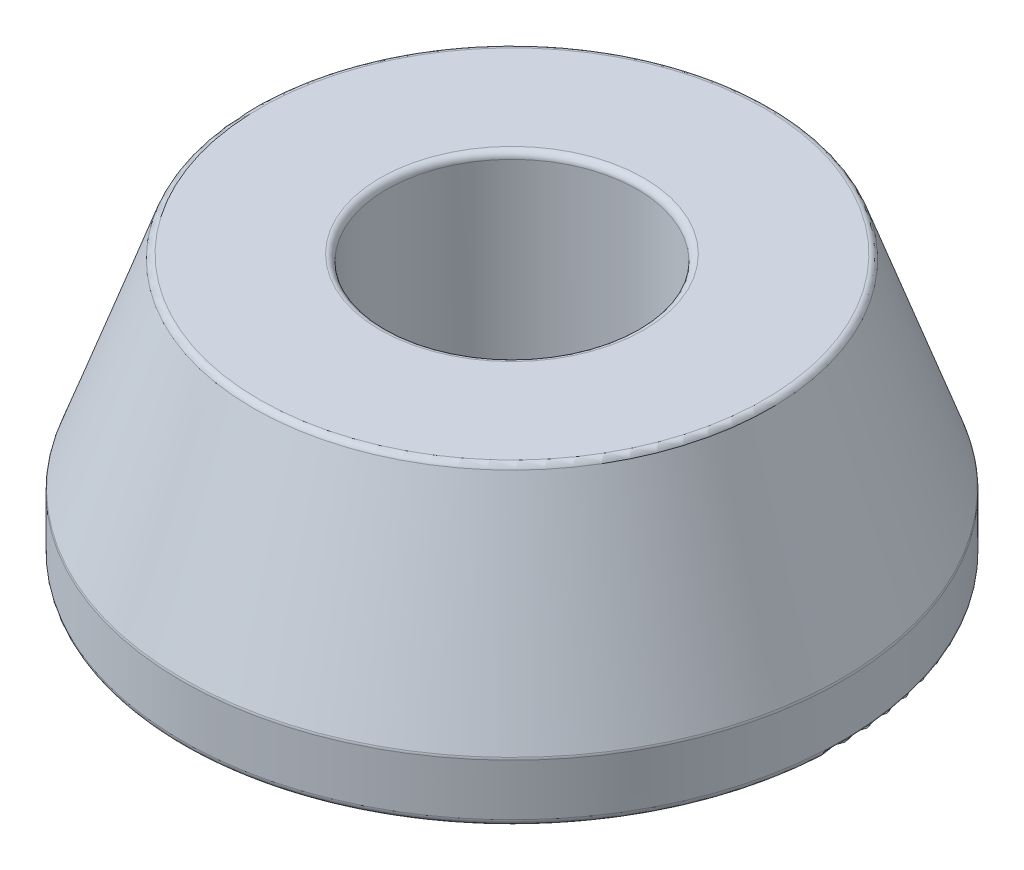
ISO-10303-21;
HEADER;
FILE_DESCRIPTION(('STEP AP214'),'2;1');
FILE_NAME('part.step','',(''),(''),'','','');
FILE_SCHEMA(('AUTOMOTIVE_DESIGN { 1 0 10303 214 1 1 1 1 }'));
ENDSEC;
DATA;
#1=APPLICATION_CONTEXT('core data for automotive mechanical design processes');
#2=APPLICATION_PROTOCOL_DEFINITION('international standard','automotive_design',2000,#1);
#3=PRODUCT_CONTEXT('',#1,'mechanical');
#4=PRODUCT('Part','Part','',(#3));
#5=PRODUCT_RELATED_PRODUCT_CATEGORY('part','',(#4));
#6=PRODUCT_DEFINITION_FORMATION('','',#4);
#7=PRODUCT_DEFINITION_CONTEXT('part definition',#1,'design');
#8=PRODUCT_DEFINITION('design','',#6,#7);
#9=PRODUCT_DEFINITION_SHAPE('','',#8);
#10=(LENGTH_UNIT() NAMED_UNIT(*) SI_UNIT(.MILLI.,.METRE.));
#11=(NAMED_UNIT(*) PLANE_ANGLE_UNIT() SI_UNIT($,.RADIAN.));
#12=(NAMED_UNIT(*) SI_UNIT($,.STERADIAN.) SOLID_ANGLE_UNIT());
#13=UNCERTAINTY_MEASURE_WITH_UNIT(LENGTH_MEASURE(1.E-05),#10,'distance_accuracy_value','');
#14=(GEOMETRIC_REPRESENTATION_CONTEXT(3) GLOBAL_UNCERTAINTY_ASSIGNED_CONTEXT((#13)) GLOBAL_UNIT_ASSIGNED_CONTEXT((#10,
#11,#12)) REPRESENTATION_CONTEXT('',''));
#15=CARTESIAN_POINT('',(0.,0.,0.));
#16=DIRECTION('',(0.,0.,1.));
#17=DIRECTION('',(1.,0.,0.));
#18=AXIS2_PLACEMENT_3D('',#15,#16,#17);
#19=CARTESIAN_POINT('',(0.,0.,0.));
#20=DIRECTION('',(0.,-1.,0.));
#21=DIRECTION('',(0.,0.,-1.));
#22=AXIS2_PLACEMENT_3D('',#19,#20,#21);
#23=CYLINDRICAL_SURFACE('',#22,4.75);
#24=CARTESIAN_POINT('',(0.,9.75,0.));
#25=DIRECTION('',(0.,1.,0.));
#26=DIRECTION('',(0.,0.,1.));
#27=AXIS2_PLACEMENT_3D('',#24,#25,#26);
#28=CIRCLE('',#27,4.75);
#29=CARTESIAN_POINT('',(0.,9.75,4.75));
#30=VERTEX_POINT('',#29);
#31=EDGE_CURVE('E62',#30,#30,#28,.T.);
#32=ORIENTED_EDGE('',*,*,#31,.T.);
#33=EDGE_LOOP('',(#32));
#34=FACE_BOUND('',#33,.T.);
#35=CARTESIAN_POINT('',(0.,0.25,0.));
#36=DIRECTION('',(0.,-1.,0.));
#37=DIRECTION('',(0.,0.,-1.));
#38=AXIS2_PLACEMENT_3D('',#35,#36,#37);
#39=CIRCLE('',#38,4.75);
#40=CARTESIAN_POINT('',(0.,0.25,-4.75));
#41=VERTEX_POINT('',#40);
#42=EDGE_CURVE('E66',#41,#41,#39,.T.);
#43=ORIENTED_EDGE('',*,*,#42,.T.);
#44=EDGE_LOOP('',(#43));
#45=FACE_BOUND('',#44,.T.);
#46=ADVANCED_FACE('F32',(#34,#45),#23,.F.);
#47=CARTESIAN_POINT('',(4.75,10.,0.));
#48=DIRECTION('',(0.,1.,0.));
#49=DIRECTION('',(0.,0.,1.));
#50=AXIS2_PLACEMENT_3D('',#47,#48,#49);
#51=PLANE('',#50);
#52=CARTESIAN_POINT('',(0.,10.,0.));
#53=DIRECTION('',(0.,1.,0.));
#54=DIRECTION('',(0.,0.,1.));
#55=AXIS2_PLACEMENT_3D('',#52,#53,#54);
#56=CIRCLE('',#55,5.);
#57=CARTESIAN_POINT('',(0.,10.,5.));
#58=VERTEX_POINT('',#57);
#59=EDGE_CURVE('E69',#58,#58,#56,.F.);
#60=ORIENTED_EDGE('',*,*,#59,.T.);
#61=EDGE_LOOP('',(#60));
#62=FACE_BOUND('',#61,.T.);
#63=CARTESIAN_POINT('',(0.,10.,0.));
#64=DIRECTION('',(0.,1.,0.));
#65=DIRECTION('',(0.,0.,1.));
#66=AXIS2_PLACEMENT_3D('',#63,#64,#65);
#67=CIRCLE('',#66,9.57343735155809);
#68=CARTESIAN_POINT('',(0.,10.,9.57343735155809));
#69=VERTEX_POINT('',#68);
#70=EDGE_CURVE('E73',#69,#69,#67,.T.);
#71=ORIENTED_EDGE('',*,*,#70,.T.);
#72=EDGE_LOOP('',(#71));
#73=FACE_BOUND('',#72,.T.);
#74=ADVANCED_FACE('F77',(#62,#73),#51,.T.);
#75=CARTESIAN_POINT('',(0.,2.25,0.));
#76=DIRECTION('',(0.,-1.,0.));
#77=DIRECTION('',(0.,0.,-1.));
#78=AXIS2_PLACEMENT_3D('',#75,#76,#77);
#79=CONICAL_SURFACE('',#78,12.5,0.34097895349635);
#80=CARTESIAN_POINT('',(0.,2.29056227022912,0.));
#81=DIRECTION('',(0.,1.,0.));
#82=DIRECTION('',(0.,0.,1.));
#83=AXIS2_PLACEMENT_3D('',#80,#81,#82);
#84=CIRCLE('',#83,12.4856069363703);
#85=CARTESIAN_POINT('',(0.,2.29056227022912,12.4856069363703));
#86=VERTEX_POINT('',#85);
#87=EDGE_CURVE('E10',#86,#86,#84,.T.);
#88=ORIENTED_EDGE('',*,*,#87,.T.);
#89=EDGE_LOOP('',(#88));
#90=FACE_BOUND('',#89,.T.);
#91=CARTESIAN_POINT('',(0.,9.83360246129269,0.));
#92=DIRECTION('',(0.,1.,0.));
#93=DIRECTION('',(0.,0.,1.));
#94=AXIS2_PLACEMENT_3D('',#91,#92,#93);
#95=CIRCLE('',#94,9.8090442879284);
#96=CARTESIAN_POINT('',(0.,9.83360246129269,9.8090442879284));
#97=VERTEX_POINT('',#96);
#98=EDGE_CURVE('E40',#97,#97,#95,.F.);
#99=ORIENTED_EDGE('',*,*,#98,.T.);
#100=EDGE_LOOP('',(#99));
#101=FACE_BOUND('',#100,.T.);
#102=ADVANCED_FACE('F93',(#90,#101),#79,.T.);
#103=CARTESIAN_POINT('',(0.,0.,0.));
#104=DIRECTION('',(0.,-1.,0.));
#105=DIRECTION('',(0.,0.,-1.));
#106=AXIS2_PLACEMENT_3D('',#103,#104,#105);
#107=CYLINDRICAL_SURFACE('',#106,12.5);
#108=CARTESIAN_POINT('',(0.,0.25,0.));
#109=DIRECTION('',(0.,-1.,0.));
#110=DIRECTION('',(0.,0.,-1.));
#111=AXIS2_PLACEMENT_3D('',#108,#109,#110);
#112=CIRCLE('',#111,12.5);
#113=CARTESIAN_POINT('',(0.,0.25,-12.5));
#114=VERTEX_POINT('',#113);
#115=EDGE_CURVE('E46',#114,#114,#112,.F.);
#116=ORIENTED_EDGE('',*,*,#115,.T.);
#117=EDGE_LOOP('',(#116));
#118=FACE_BOUND('',#117,.T.);
#119=CARTESIAN_POINT('',(0.,2.20695980893643,0.));
#120=DIRECTION('',(0.,1.,0.));
#121=DIRECTION('',(0.,0.,1.));
#122=AXIS2_PLACEMENT_3D('',#119,#120,#121);
#123=CIRCLE('',#122,12.5);
#124=CARTESIAN_POINT('',(0.,2.20695980893643,12.5));
#125=VERTEX_POINT('',#124);
#126=EDGE_CURVE('E51',#125,#125,#123,.F.);
#127=ORIENTED_EDGE('',*,*,#126,.T.);
#128=EDGE_LOOP('',(#127));
#129=FACE_BOUND('',#128,.T.);
#130=ADVANCED_FACE('F117',(#118,#129),#107,.T.);
#131=CARTESIAN_POINT('',(12.5,0.,0.));
#132=DIRECTION('',(0.,-1.,0.));
#133=DIRECTION('',(0.,0.,-1.));
#134=AXIS2_PLACEMENT_3D('',#131,#132,#133);
#135=PLANE('',#134);
#136=CARTESIAN_POINT('',(0.,0.,0.));
#137=DIRECTION('',(0.,-1.,0.));
#138=DIRECTION('',(0.,0.,-1.));
#139=AXIS2_PLACEMENT_3D('',#136,#137,#138);
#140=CIRCLE('',#139,5.);
#141=CARTESIAN_POINT('',(0.,0.,-5.));
#142=VERTEX_POINT('',#141);
#143=EDGE_CURVE('E56',#142,#142,#140,.F.);
#144=ORIENTED_EDGE('',*,*,#143,.T.);
#145=EDGE_LOOP('',(#144));
#146=FACE_BOUND('',#145,.T.);
#147=CARTESIAN_POINT('',(0.,0.,0.));
#148=DIRECTION('',(0.,-1.,0.));
#149=DIRECTION('',(0.,0.,-1.));
#150=AXIS2_PLACEMENT_3D('',#147,#148,#149);
#151=CIRCLE('',#150,12.25);
#152=CARTESIAN_POINT('',(0.,0.,-12.25));
#153=VERTEX_POINT('',#152);
#154=EDGE_CURVE('E59',#153,#153,#151,.T.);
#155=ORIENTED_EDGE('',*,*,#154,.T.);
#156=EDGE_LOOP('',(#155));
#157=FACE_BOUND('',#156,.T.);
#158=ADVANCED_FACE('F103',(#146,#157),#135,.T.);
#159=CARTESIAN_POINT('',(0.,9.75,0.));
#160=DIRECTION('',(0.,1.,0.));
#161=DIRECTION('',(0.,0.,1.));
#162=AXIS2_PLACEMENT_3D('',#159,#160,#161);
#163=TOROIDAL_SURFACE('',#162,5.,0.25);
#164=ORIENTED_EDGE('',*,*,#31,.F.);
#165=EDGE_LOOP('',(#164));
#166=FACE_BOUND('',#165,.T.);
#167=ORIENTED_EDGE('',*,*,#59,.F.);
#168=EDGE_LOOP('',(#167));
#169=FACE_BOUND('',#168,.T.);
#170=ADVANCED_FACE('F99',(#166,#169),#163,.T.);
#171=CARTESIAN_POINT('',(0.,0.25,0.));
#172=DIRECTION('',(0.,-1.,0.));
#173=DIRECTION('',(0.,0.,-1.));
#174=AXIS2_PLACEMENT_3D('',#171,#172,#173);
#175=TOROIDAL_SURFACE('',#174,5.,0.25);
#176=ORIENTED_EDGE('',*,*,#143,.F.);
#177=EDGE_LOOP('',(#176));
#178=FACE_BOUND('',#177,.T.);
#179=ORIENTED_EDGE('',*,*,#42,.F.);
#180=EDGE_LOOP('',(#179));
#181=FACE_BOUND('',#180,.T.);
#182=ADVANCED_FACE('F102',(#178,#181),#175,.T.);
#183=CARTESIAN_POINT('',(0.,0.25,0.));
#184=DIRECTION('',(0.,-1.,0.));
#185=DIRECTION('',(0.,0.,-1.));
#186=AXIS2_PLACEMENT_3D('',#183,#184,#185);
#187=TOROIDAL_SURFACE('',#186,12.25,0.25);
#188=ORIENTED_EDGE('',*,*,#115,.F.);
#189=EDGE_LOOP('',(#188));
#190=FACE_BOUND('',#189,.T.);
#191=ORIENTED_EDGE('',*,*,#154,.F.);
#192=EDGE_LOOP('',(#191));
#193=FACE_BOUND('',#192,.T.);
#194=ADVANCED_FACE('F85',(#190,#193),#187,.T.);
#195=CARTESIAN_POINT('',(0.,2.20695980893643,0.));
#196=DIRECTION('',(0.,1.,0.));
#197=DIRECTION('',(0.,0.,1.));
#198=AXIS2_PLACEMENT_3D('',#195,#196,#197);
#199=TOROIDAL_SURFACE('',#198,12.25,0.25);
#200=ORIENTED_EDGE('',*,*,#87,.F.);
#201=EDGE_LOOP('',(#200));
#202=FACE_BOUND('',#201,.T.);
#203=ORIENTED_EDGE('',*,*,#126,.F.);
#204=EDGE_LOOP('',(#203));
#205=FACE_BOUND('',#204,.T.);
#206=ADVANCED_FACE('F81',(#202,#205),#199,.T.);
#207=CARTESIAN_POINT('',(0.,9.75,0.));
#208=DIRECTION('',(0.,1.,0.));
#209=DIRECTION('',(0.,0.,1.));
#210=AXIS2_PLACEMENT_3D('',#207,#208,#209);
#211=TOROIDAL_SURFACE('',#210,9.57343735155809,0.25);
#212=ORIENTED_EDGE('',*,*,#70,.F.);
#213=EDGE_LOOP('',(#212));
#214=FACE_BOUND('',#213,.T.);
#215=ORIENTED_EDGE('',*,*,#98,.F.);
#216=EDGE_LOOP('',(#215));
#217=FACE_BOUND('',#216,.T.);
#218=ADVANCED_FACE('F34',(#214,#217),#211,.T.);
#219=CLOSED_SHELL('',(#46,#74,#102,#130,#158,#170,#182,#194,#206,#218));
#220=MANIFOLD_SOLID_BREP('B2',#219);
#221=ADVANCED_BREP_SHAPE_REPRESENTATION('',(#18,#220),#14);
#222=SHAPE_DEFINITION_REPRESENTATION(#9,#221);
ENDSEC;
END-ISO-10303-21;
